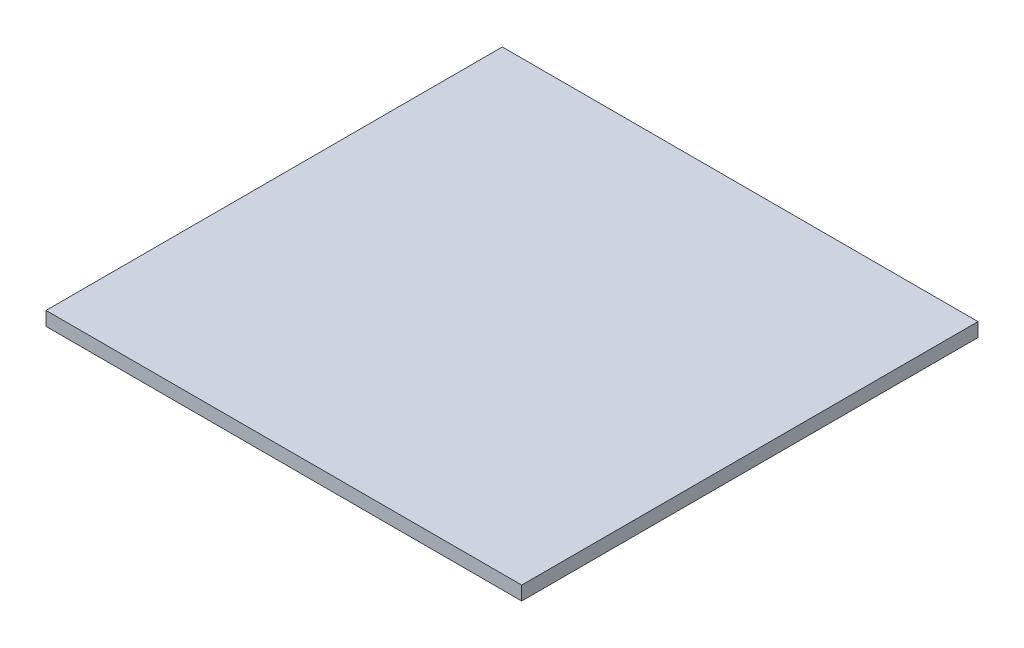
ISO-10303-21;
HEADER;
FILE_DESCRIPTION(('STEP AP214'),'2;1');
FILE_NAME('part.step','',(''),(''),'','','');
FILE_SCHEMA(('AUTOMOTIVE_DESIGN { 1 0 10303 214 1 1 1 1 }'));
ENDSEC;
DATA;
#1=APPLICATION_CONTEXT('core data for automotive mechanical design processes');
#2=APPLICATION_PROTOCOL_DEFINITION('international standard','automotive_design',2000,#1);
#3=PRODUCT_CONTEXT('',#1,'mechanical');
#4=PRODUCT('Part','Part','',(#3));
#5=PRODUCT_RELATED_PRODUCT_CATEGORY('part','',(#4));
#6=PRODUCT_DEFINITION_FORMATION('','',#4);
#7=PRODUCT_DEFINITION_CONTEXT('part definition',#1,'design');
#8=PRODUCT_DEFINITION('design','',#6,#7);
#9=PRODUCT_DEFINITION_SHAPE('','',#8);
#10=(LENGTH_UNIT() NAMED_UNIT(*) SI_UNIT(.MILLI.,.METRE.));
#11=(NAMED_UNIT(*) PLANE_ANGLE_UNIT() SI_UNIT($,.RADIAN.));
#12=(NAMED_UNIT(*) SI_UNIT($,.STERADIAN.) SOLID_ANGLE_UNIT());
#13=UNCERTAINTY_MEASURE_WITH_UNIT(LENGTH_MEASURE(1.E-05),#10,'distance_accuracy_value','');
#14=(GEOMETRIC_REPRESENTATION_CONTEXT(3) GLOBAL_UNCERTAINTY_ASSIGNED_CONTEXT((#13)) GLOBAL_UNIT_ASSIGNED_CONTEXT((#10,
#11,#12)) REPRESENTATION_CONTEXT('',''));
#15=CARTESIAN_POINT('',(0.,0.,0.));
#16=DIRECTION('',(0.,0.,1.));
#17=DIRECTION('',(1.,0.,0.));
#18=AXIS2_PLACEMENT_3D('',#15,#16,#17);
#19=CARTESIAN_POINT('',(-44.2815420560747,3.,-20.6980140186916));
#20=DIRECTION('',(1.,0.,0.));
#21=DIRECTION('',(0.,0.,-1.));
#22=AXIS2_PLACEMENT_3D('',#19,#20,#21);
#23=PLANE('',#22);
#24=DIRECTION('',(0.,0.,1.));
#25=VECTOR('',#24,1.);
#26=CARTESIAN_POINT('',(-44.2815420560747,0.,-20.6980140186916));
#27=LINE('',#26,#25);
#28=CARTESIAN_POINT('',(-44.2815420560747,0.,-20.6980140186916));
#29=VERTEX_POINT('',#28);
#30=CARTESIAN_POINT('',(-44.2815420560747,0.,78.1019859813084));
#31=VERTEX_POINT('',#30);
#32=EDGE_CURVE('E96',#29,#31,#27,.T.);
#33=ORIENTED_EDGE('',*,*,#32,.T.);
#34=DIRECTION('',(0.,-1.,0.));
#35=VECTOR('',#34,1.);
#36=CARTESIAN_POINT('',(-44.2815420560747,3.,78.1019859813084));
#37=LINE('',#36,#35);
#38=CARTESIAN_POINT('',(-44.2815420560747,3.,78.1019859813084));
#39=VERTEX_POINT('',#38);
#40=EDGE_CURVE('E11',#39,#31,#37,.T.);
#41=ORIENTED_EDGE('',*,*,#40,.F.);
#42=DIRECTION('',(0.,0.,1.));
#43=VECTOR('',#42,1.);
#44=CARTESIAN_POINT('',(-44.2815420560747,3.,-20.6980140186916));
#45=LINE('',#44,#43);
#46=CARTESIAN_POINT('',(-44.2815420560747,3.,-20.6980140186916));
#47=VERTEX_POINT('',#46);
#48=EDGE_CURVE('E84',#47,#39,#45,.T.);
#49=ORIENTED_EDGE('',*,*,#48,.F.);
#50=DIRECTION('',(0.,-1.,0.));
#51=VECTOR('',#50,1.);
#52=CARTESIAN_POINT('',(-44.2815420560747,3.,-20.6980140186916));
#53=LINE('',#52,#51);
#54=EDGE_CURVE('E92',#47,#29,#53,.T.);
#55=ORIENTED_EDGE('',*,*,#54,.T.);
#56=EDGE_LOOP('',(#33,#41,#49,#55));
#57=FACE_BOUND('',#56,.T.);
#58=ADVANCED_FACE('F33',(#57),#23,.F.);
#59=CARTESIAN_POINT('',(-44.2815420560747,3.,78.1019859813084));
#60=DIRECTION('',(0.,0.,-1.));
#61=DIRECTION('',(-1.,0.,0.));
#62=AXIS2_PLACEMENT_3D('',#59,#60,#61);
#63=PLANE('',#62);
#64=DIRECTION('',(1.,0.,0.));
#65=VECTOR('',#64,1.);
#66=CARTESIAN_POINT('',(-44.2815420560747,0.,78.1019859813084));
#67=LINE('',#66,#65);
#68=CARTESIAN_POINT('',(58.7184579439253,0.,78.1019859813084));
#69=VERTEX_POINT('',#68);
#70=EDGE_CURVE('E88',#31,#69,#67,.T.);
#71=ORIENTED_EDGE('',*,*,#70,.T.);
#72=DIRECTION('',(0.,-1.,0.));
#73=VECTOR('',#72,1.);
#74=CARTESIAN_POINT('',(58.7184579439253,3.,78.1019859813084));
#75=LINE('',#74,#73);
#76=CARTESIAN_POINT('',(58.7184579439253,3.,78.1019859813084));
#77=VERTEX_POINT('',#76);
#78=EDGE_CURVE('E41',#77,#69,#75,.T.);
#79=ORIENTED_EDGE('',*,*,#78,.F.);
#80=DIRECTION('',(1.,0.,0.));
#81=VECTOR('',#80,1.);
#82=CARTESIAN_POINT('',(-44.2815420560747,3.,78.1019859813084));
#83=LINE('',#82,#81);
#84=EDGE_CURVE('E79',#39,#77,#83,.T.);
#85=ORIENTED_EDGE('',*,*,#84,.F.);
#86=ORIENTED_EDGE('',*,*,#40,.T.);
#87=EDGE_LOOP('',(#71,#79,#85,#86));
#88=FACE_BOUND('',#87,.T.);
#89=ADVANCED_FACE('F87',(#88),#63,.F.);
#90=CARTESIAN_POINT('',(58.7184579439252,3.,-20.6980140186916));
#91=DIRECTION('',(-1.,0.,0.));
#92=DIRECTION('',(0.,0.,1.));
#93=AXIS2_PLACEMENT_3D('',#90,#91,#92);
#94=PLANE('',#93);
#95=DIRECTION('',(0.,0.,-1.));
#96=VECTOR('',#95,1.);
#97=CARTESIAN_POINT('',(58.7184579439252,0.,-20.6980140186916));
#98=LINE('',#97,#96);
#99=CARTESIAN_POINT('',(58.7184579439252,0.,-20.6980140186916));
#100=VERTEX_POINT('',#99);
#101=EDGE_CURVE('E66',#69,#100,#98,.T.);
#102=ORIENTED_EDGE('',*,*,#101,.T.);
#103=DIRECTION('',(0.,-1.,0.));
#104=VECTOR('',#103,1.);
#105=CARTESIAN_POINT('',(58.7184579439252,3.,-20.6980140186916));
#106=LINE('',#105,#104);
#107=CARTESIAN_POINT('',(58.7184579439252,3.,-20.6980140186916));
#108=VERTEX_POINT('',#107);
#109=EDGE_CURVE('E89',#108,#100,#106,.T.);
#110=ORIENTED_EDGE('',*,*,#109,.F.);
#111=DIRECTION('',(0.,0.,-1.));
#112=VECTOR('',#111,1.);
#113=CARTESIAN_POINT('',(58.7184579439252,3.,-20.6980140186916));
#114=LINE('',#113,#112);
#115=EDGE_CURVE('E82',#77,#108,#114,.T.);
#116=ORIENTED_EDGE('',*,*,#115,.F.);
#117=ORIENTED_EDGE('',*,*,#78,.T.);
#118=EDGE_LOOP('',(#102,#110,#116,#117));
#119=FACE_BOUND('',#118,.T.);
#120=ADVANCED_FACE('F90',(#119),#94,.F.);
#121=CARTESIAN_POINT('',(-44.2815420560747,3.,-20.6980140186916));
#122=DIRECTION('',(0.,0.,1.));
#123=DIRECTION('',(1.,0.,0.));
#124=AXIS2_PLACEMENT_3D('',#121,#122,#123);
#125=PLANE('',#124);
#126=DIRECTION('',(-1.,0.,0.));
#127=VECTOR('',#126,1.);
#128=CARTESIAN_POINT('',(-44.2815420560747,0.,-20.6980140186916));
#129=LINE('',#128,#127);
#130=EDGE_CURVE('E72',#100,#29,#129,.T.);
#131=ORIENTED_EDGE('',*,*,#130,.T.);
#132=ORIENTED_EDGE('',*,*,#54,.F.);
#133=DIRECTION('',(-1.,0.,0.));
#134=VECTOR('',#133,1.);
#135=CARTESIAN_POINT('',(-44.2815420560747,3.,-20.6980140186916));
#136=LINE('',#135,#134);
#137=EDGE_CURVE('E49',#108,#47,#136,.T.);
#138=ORIENTED_EDGE('',*,*,#137,.F.);
#139=ORIENTED_EDGE('',*,*,#109,.T.);
#140=EDGE_LOOP('',(#131,#132,#138,#139));
#141=FACE_BOUND('',#140,.T.);
#142=ADVANCED_FACE('F103',(#141),#125,.F.);
#143=CARTESIAN_POINT('',(0.,3.,0.));
#144=DIRECTION('',(0.,1.,0.));
#145=DIRECTION('',(0.,0.,1.));
#146=AXIS2_PLACEMENT_3D('',#143,#144,#145);
#147=PLANE('',#146);
#148=ORIENTED_EDGE('',*,*,#48,.T.);
#149=ORIENTED_EDGE('',*,*,#84,.T.);
#150=ORIENTED_EDGE('',*,*,#115,.T.);
#151=ORIENTED_EDGE('',*,*,#137,.T.);
#152=EDGE_LOOP('',(#148,#149,#150,#151));
#153=FACE_BOUND('',#152,.T.);
#154=ADVANCED_FACE('F80',(#153),#147,.T.);
#155=CARTESIAN_POINT('',(0.,0.,0.));
#156=DIRECTION('',(0.,1.,0.));
#157=DIRECTION('',(0.,0.,1.));
#158=AXIS2_PLACEMENT_3D('',#155,#156,#157);
#159=PLANE('',#158);
#160=ORIENTED_EDGE('',*,*,#32,.F.);
#161=ORIENTED_EDGE('',*,*,#130,.F.);
#162=ORIENTED_EDGE('',*,*,#101,.F.);
#163=ORIENTED_EDGE('',*,*,#70,.F.);
#164=EDGE_LOOP('',(#160,#161,#162,#163));
#165=FACE_BOUND('',#164,.T.);
#166=ADVANCED_FACE('F106',(#165),#159,.F.);
#167=CLOSED_SHELL('',(#58,#89,#120,#142,#154,#166));
#168=MANIFOLD_SOLID_BREP('B2',#167);
#169=ADVANCED_BREP_SHAPE_REPRESENTATION('',(#18,#168),#14);
#170=SHAPE_DEFINITION_REPRESENTATION(#9,#169);
ENDSEC;
END-ISO-10303-21;
